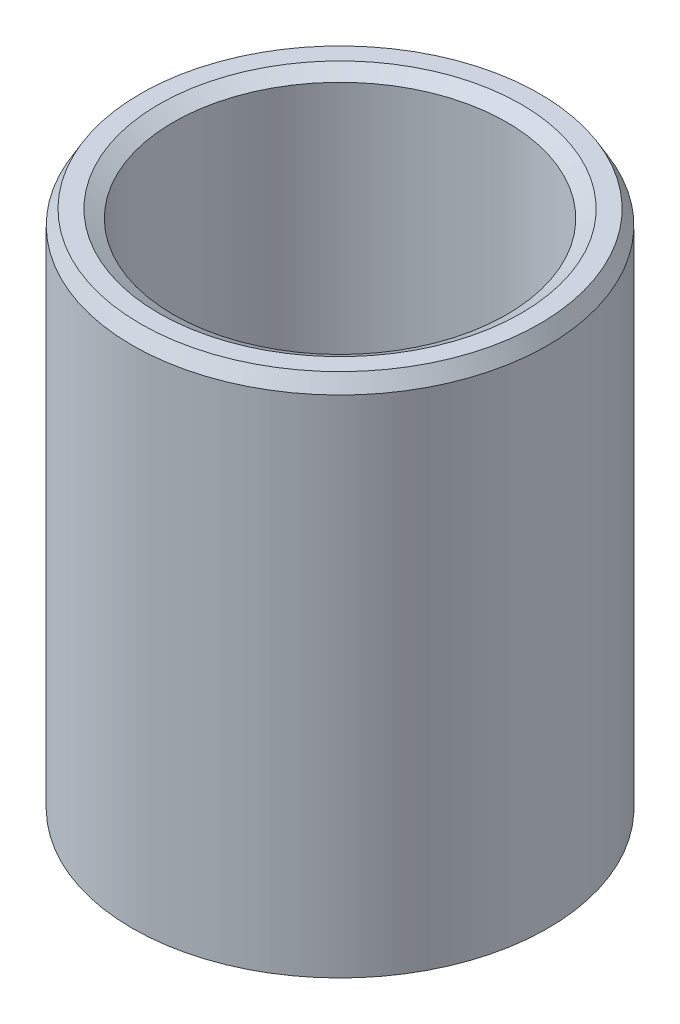
ISO-10303-21;
HEADER;
FILE_DESCRIPTION(('STEP AP214'),'2;1');
FILE_NAME('part.step','',(''),(''),'','','');
FILE_SCHEMA(('AUTOMOTIVE_DESIGN { 1 0 10303 214 1 1 1 1 }'));
ENDSEC;
DATA;
#1=APPLICATION_CONTEXT('core data for automotive mechanical design processes');
#2=APPLICATION_PROTOCOL_DEFINITION('international standard','automotive_design',2000,#1);
#3=PRODUCT_CONTEXT('',#1,'mechanical');
#4=PRODUCT('Part','Part','',(#3));
#5=PRODUCT_RELATED_PRODUCT_CATEGORY('part','',(#4));
#6=PRODUCT_DEFINITION_FORMATION('','',#4);
#7=PRODUCT_DEFINITION_CONTEXT('part definition',#1,'design');
#8=PRODUCT_DEFINITION('design','',#6,#7);
#9=PRODUCT_DEFINITION_SHAPE('','',#8);
#10=(LENGTH_UNIT() NAMED_UNIT(*) SI_UNIT(.MILLI.,.METRE.));
#11=(NAMED_UNIT(*) PLANE_ANGLE_UNIT() SI_UNIT($,.RADIAN.));
#12=(NAMED_UNIT(*) SI_UNIT($,.STERADIAN.) SOLID_ANGLE_UNIT());
#13=UNCERTAINTY_MEASURE_WITH_UNIT(LENGTH_MEASURE(1.E-05),#10,'distance_accuracy_value','');
#14=(GEOMETRIC_REPRESENTATION_CONTEXT(3) GLOBAL_UNCERTAINTY_ASSIGNED_CONTEXT((#13)) GLOBAL_UNIT_ASSIGNED_CONTEXT((#10,
#11,#12)) REPRESENTATION_CONTEXT('',''));
#15=CARTESIAN_POINT('',(0.,0.,0.));
#16=DIRECTION('',(0.,0.,1.));
#17=DIRECTION('',(1.,0.,0.));
#18=AXIS2_PLACEMENT_3D('',#15,#16,#17);
#19=CARTESIAN_POINT('',(0.,82.520346828198,0.));
#20=DIRECTION('',(0.,-1.,0.));
#21=DIRECTION('',(0.,0.,-1.));
#22=AXIS2_PLACEMENT_3D('',#19,#20,#21);
#23=CYLINDRICAL_SURFACE('',#22,32.5);
#24=CARTESIAN_POINT('',(0.,1.30030227955019,0.));
#25=DIRECTION('',(0.,1.,0.));
#26=DIRECTION('',(0.,0.,1.));
#27=AXIS2_PLACEMENT_3D('',#24,#25,#26);
#28=CIRCLE('',#27,32.5);
#29=CARTESIAN_POINT('',(0.,1.30030227955019,32.5));
#30=VERTEX_POINT('',#29);
#31=EDGE_CURVE('E10',#30,#30,#28,.T.);
#32=ORIENTED_EDGE('',*,*,#31,.T.);
#33=EDGE_LOOP('',(#32));
#34=FACE_BOUND('',#33,.T.);
#35=CARTESIAN_POINT('',(0.,80.2681572148194,0.));
#36=DIRECTION('',(0.,1.,0.));
#37=DIRECTION('',(0.,0.,1.));
#38=AXIS2_PLACEMENT_3D('',#35,#36,#37);
#39=CIRCLE('',#38,32.5);
#40=CARTESIAN_POINT('',(0.,80.2681572148194,32.5));
#41=VERTEX_POINT('',#40);
#42=EDGE_CURVE('E50',#41,#41,#39,.F.);
#43=ORIENTED_EDGE('',*,*,#42,.T.);
#44=EDGE_LOOP('',(#43));
#45=FACE_BOUND('',#44,.T.);
#46=ADVANCED_FACE('F39',(#34,#45),#23,.T.);
#47=CARTESIAN_POINT('',(0.,82.520346828198,0.));
#48=DIRECTION('',(0.,1.,0.));
#49=DIRECTION('',(0.,0.,1.));
#50=AXIS2_PLACEMENT_3D('',#47,#48,#49);
#51=PLANE('',#50);
#52=CARTESIAN_POINT('',(0.,82.520346828198,0.));
#53=DIRECTION('',(0.,1.,0.));
#54=DIRECTION('',(0.,0.,1.));
#55=AXIS2_PLACEMENT_3D('',#52,#53,#54);
#56=CIRCLE('',#55,28.3278194605698);
#57=CARTESIAN_POINT('',(0.,82.520346828198,28.3278194605698));
#58=VERTEX_POINT('',#57);
#59=EDGE_CURVE('E58',#58,#58,#56,.F.);
#60=ORIENTED_EDGE('',*,*,#59,.T.);
#61=EDGE_LOOP('',(#60));
#62=FACE_BOUND('',#61,.T.);
#63=CARTESIAN_POINT('',(0.,82.520346828198,0.));
#64=DIRECTION('',(0.,1.,0.));
#65=DIRECTION('',(0.,0.,1.));
#66=AXIS2_PLACEMENT_3D('',#63,#64,#65);
#67=CIRCLE('',#66,31.1996977204498);
#68=CARTESIAN_POINT('',(0.,82.520346828198,31.1996977204498));
#69=VERTEX_POINT('',#68);
#70=EDGE_CURVE('E61',#69,#69,#67,.T.);
#71=ORIENTED_EDGE('',*,*,#70,.T.);
#72=EDGE_LOOP('',(#71));
#73=FACE_BOUND('',#72,.T.);
#74=ADVANCED_FACE('F88',(#62,#73),#51,.T.);
#75=CARTESIAN_POINT('',(0.,0.,0.));
#76=DIRECTION('',(0.,1.,0.));
#77=DIRECTION('',(0.,0.,1.));
#78=AXIS2_PLACEMENT_3D('',#75,#76,#77);
#79=PLANE('',#78);
#80=CARTESIAN_POINT('',(0.,0.,0.));
#81=DIRECTION('',(0.,1.,0.));
#82=DIRECTION('',(0.,0.,1.));
#83=AXIS2_PLACEMENT_3D('',#80,#81,#82);
#84=CIRCLE('',#83,27.3759321267415);
#85=CARTESIAN_POINT('',(0.,0.,27.3759321267415));
#86=VERTEX_POINT('',#85);
#87=EDGE_CURVE('E51',#86,#86,#84,.T.);
#88=ORIENTED_EDGE('',*,*,#87,.T.);
#89=EDGE_LOOP('',(#88));
#90=FACE_BOUND('',#89,.T.);
#91=CARTESIAN_POINT('',(0.,0.,0.));
#92=DIRECTION('',(0.,1.,0.));
#93=DIRECTION('',(0.,0.,1.));
#94=AXIS2_PLACEMENT_3D('',#91,#92,#93);
#95=CIRCLE('',#94,30.2478103866214);
#96=CARTESIAN_POINT('',(0.,0.,30.2478103866214));
#97=VERTEX_POINT('',#96);
#98=EDGE_CURVE('E54',#97,#97,#95,.F.);
#99=ORIENTED_EDGE('',*,*,#98,.T.);
#100=EDGE_LOOP('',(#99));
#101=FACE_BOUND('',#100,.T.);
#102=ADVANCED_FACE('F83',(#90,#101),#79,.F.);
#103=CARTESIAN_POINT('',(0.,82.520346828198,0.));
#104=DIRECTION('',(0.,-1.,0.));
#105=DIRECTION('',(0.,0.,-1.));
#106=AXIS2_PLACEMENT_3D('',#103,#104,#105);
#107=CYLINDRICAL_SURFACE('',#106,26.0756298471913);
#108=CARTESIAN_POINT('',(0.,81.2200445486478,0.));
#109=DIRECTION('',(0.,1.,0.));
#110=DIRECTION('',(0.,0.,1.));
#111=AXIS2_PLACEMENT_3D('',#108,#109,#110);
#112=CIRCLE('',#111,26.0756298471913);
#113=CARTESIAN_POINT('',(0.,81.2200445486478,26.0756298471913));
#114=VERTEX_POINT('',#113);
#115=EDGE_CURVE('E67',#114,#114,#112,.T.);
#116=ORIENTED_EDGE('',*,*,#115,.T.);
#117=EDGE_LOOP('',(#116));
#118=FACE_BOUND('',#117,.T.);
#119=CARTESIAN_POINT('',(0.,2.25218961337859,0.));
#120=DIRECTION('',(0.,1.,0.));
#121=DIRECTION('',(0.,0.,1.));
#122=AXIS2_PLACEMENT_3D('',#119,#120,#121);
#123=CIRCLE('',#122,26.0756298471913);
#124=CARTESIAN_POINT('',(0.,2.25218961337859,26.0756298471913));
#125=VERTEX_POINT('',#124);
#126=EDGE_CURVE('E69',#125,#125,#123,.F.);
#127=ORIENTED_EDGE('',*,*,#126,.T.);
#128=EDGE_LOOP('',(#127));
#129=FACE_BOUND('',#128,.T.);
#130=ADVANCED_FACE('F71',(#118,#129),#107,.F.);
#131=CARTESIAN_POINT('',(0.,81.2200445486478,0.));
#132=DIRECTION('',(0.,1.,0.));
#133=DIRECTION('',(0.,0.,1.));
#134=AXIS2_PLACEMENT_3D('',#131,#132,#133);
#135=CONICAL_SURFACE('',#134,26.0756298471913,1.0471975511966);
#136=ORIENTED_EDGE('',*,*,#59,.F.);
#137=EDGE_LOOP('',(#136));
#138=FACE_BOUND('',#137,.T.);
#139=ORIENTED_EDGE('',*,*,#115,.F.);
#140=EDGE_LOOP('',(#139));
#141=FACE_BOUND('',#140,.T.);
#142=ADVANCED_FACE('F77',(#138,#141),#135,.F.);
#143=CARTESIAN_POINT('',(0.,0.,0.));
#144=DIRECTION('',(0.,-1.,0.));
#145=DIRECTION('',(0.,0.,-1.));
#146=AXIS2_PLACEMENT_3D('',#143,#144,#145);
#147=CONICAL_SURFACE('',#146,27.3759321267415,0.523598775598294);
#148=ORIENTED_EDGE('',*,*,#126,.F.);
#149=EDGE_LOOP('',(#148));
#150=FACE_BOUND('',#149,.T.);
#151=ORIENTED_EDGE('',*,*,#87,.F.);
#152=EDGE_LOOP('',(#151));
#153=FACE_BOUND('',#152,.T.);
#154=ADVANCED_FACE('F73',(#150,#153),#147,.F.);
#155=CARTESIAN_POINT('',(0.,1.30030227955019,0.));
#156=DIRECTION('',(0.,1.,0.));
#157=DIRECTION('',(0.,0.,1.));
#158=AXIS2_PLACEMENT_3D('',#155,#156,#157);
#159=CONICAL_SURFACE('',#158,32.5,1.0471975511966);
#160=CARTESIAN_POINT('',(0.,0.,30.2478103866214));
#161=CARTESIAN_POINT('',(0.,0.013544815411981,30.2712706950941));
#162=CARTESIAN_POINT('',(0.,0.0270896308239621,30.2947310035668));
#163=CARTESIAN_POINT('',(0.,0.0541792616479244,30.3416516205122));
#164=CARTESIAN_POINT('',(0.,0.0677240770599056,30.3651119289849));
#165=CARTESIAN_POINT('',(0.,0.0948137078838679,30.4120325459303));
#166=CARTESIAN_POINT('',(0.,0.108358523295849,30.435492854403));
#167=CARTESIAN_POINT('',(0.,0.135448154119811,30.4824134713484));
#168=CARTESIAN_POINT('',(0.,0.148992969531793,30.505873779821));
#169=CARTESIAN_POINT('',(0.,0.176082600355755,30.5527943967664));
#170=CARTESIAN_POINT('',(0.,0.189627415767736,30.5762547052391));
#171=CARTESIAN_POINT('',(0.,0.216717046591698,30.6231753221845));
#172=CARTESIAN_POINT('',(0.,0.23026186200368,30.6466356306572));
#173=CARTESIAN_POINT('',(0.,0.257351492827642,30.6935562476026));
#174=CARTESIAN_POINT('',(0.,0.270896308239623,30.7170165560753));
#175=CARTESIAN_POINT('',(0.,0.297985939063585,30.7639371730207));
#176=CARTESIAN_POINT('',(0.,0.311530754475567,30.7873974814934));
#177=CARTESIAN_POINT('',(0.,0.338620385299529,30.8343180984388));
#178=CARTESIAN_POINT('',(0.,0.35216520071151,30.8577784069114));
#179=CARTESIAN_POINT('',(0.,0.379254831535472,30.9046990238568));
#180=CARTESIAN_POINT('',(0.,0.392799646947454,30.9281593323295));
#181=CARTESIAN_POINT('',(0.,0.419889277771416,30.9750799492749));
#182=CARTESIAN_POINT('',(0.,0.433434093183397,30.9985402577476));
#183=CARTESIAN_POINT('',(0.,0.46052372400736,31.045460874693));
#184=CARTESIAN_POINT('',(0.,0.474068539419341,31.0689211831657));
#185=CARTESIAN_POINT('',(0.,0.501158170243303,31.1158418001111));
#186=CARTESIAN_POINT('',(0.,0.514702985655284,31.1393021085838));
#187=CARTESIAN_POINT('',(0.,0.541792616479246,31.1862227255292));
#188=CARTESIAN_POINT('',(0.,0.555337431891227,31.2096830340019));
#189=CARTESIAN_POINT('',(0.,0.58242706271519,31.2566036509472));
#190=CARTESIAN_POINT('',(0.,0.595971878127172,31.2800639594199));
#191=CARTESIAN_POINT('',(0.,0.623061508951134,31.3269845763653));
#192=CARTESIAN_POINT('',(0.,0.636606324363114,31.350444884838));
#193=CARTESIAN_POINT('',(0.,0.663695955187076,31.3973655017834));
#194=CARTESIAN_POINT('',(0.,0.677240770599059,31.4208258102561));
#195=CARTESIAN_POINT('',(0.,0.704330401423021,31.4677464272015));
#196=CARTESIAN_POINT('',(0.,0.717875216835001,31.4912067356742));
#197=CARTESIAN_POINT('',(0.,0.744964847658963,31.5381273526196));
#198=CARTESIAN_POINT('',(0.,0.758509663070946,31.5615876610923));
#199=CARTESIAN_POINT('',(0.,0.785599293894908,31.6085082780376));
#200=CARTESIAN_POINT('',(0.,0.799144109306888,31.6319685865103));
#201=CARTESIAN_POINT('',(0.,0.82623374013085,31.6788892034557));
#202=CARTESIAN_POINT('',(0.,0.839778555542833,31.7023495119284));
#203=CARTESIAN_POINT('',(0.,0.866868186366795,31.7492701288738));
#204=CARTESIAN_POINT('',(0.,0.880413001778775,31.7727304373465));
#205=CARTESIAN_POINT('',(0.,0.907502632602737,31.8196510542919));
#206=CARTESIAN_POINT('',(0.,0.921047448014719,31.8431113627646));
#207=CARTESIAN_POINT('',(0.,0.948137078838682,31.89003197971));
#208=CARTESIAN_POINT('',(0.,0.961681894250663,31.9134922881827));
#209=CARTESIAN_POINT('',(0.,0.988771525074625,31.960412905128));
#210=CARTESIAN_POINT('',(0.,1.00231634048661,31.9838732136007));
#211=CARTESIAN_POINT('',(0.,1.02940597131057,32.0307938305461));
#212=CARTESIAN_POINT('',(0.,1.04295078672255,32.0542541390188));
#213=CARTESIAN_POINT('',(0.,1.07004041754651,32.1011747559642));
#214=CARTESIAN_POINT('',(0.,1.08358523295849,32.1246350644369));
#215=CARTESIAN_POINT('',(0.,1.11067486378245,32.1715556813823));
#216=CARTESIAN_POINT('',(0.,1.12421967919444,32.195015989855));
#217=CARTESIAN_POINT('',(0.,1.1513093100184,32.2419366068004));
#218=CARTESIAN_POINT('',(0.,1.16485412543038,32.2653969152731));
#219=CARTESIAN_POINT('',(0.,1.19194375625434,32.3123175322185));
#220=CARTESIAN_POINT('',(0.,1.20548857166632,32.3357778406911));
#221=CARTESIAN_POINT('',(0.,1.23257820249029,32.3826984576365));
#222=CARTESIAN_POINT('',(0.,1.24612301790227,32.4061587661092));
#223=CARTESIAN_POINT('',(0.,1.27321264872623,32.4530793830546));
#224=CARTESIAN_POINT('',(0.,1.28675746413821,32.4765396915273));
#225=CARTESIAN_POINT('',(0.,1.30030227955019,32.5));
#226=B_SPLINE_CURVE_WITH_KNOTS('',3,(#160,#161,#162,#163,#164,#165,#166,#167,#168,#169,#170,
#171,#172,#173,#174,#175,#176,#177,#178,#179,#180,#181,#182,#183,#184,#185,#186,#187,#188,#189,
#190,#191,#192,#193,#194,#195,#196,#197,#198,#199,#200,#201,#202,#203,#204,#205,#206,#207,#208,
#209,#210,#211,#212,#213,#214,#215,#216,#217,#218,#219,#220,#221,#222,#223,#224,#225),
.UNSPECIFIED.,.F.,.F.,(4,2,2,2,2,2,2,2,2,2,2,2,2,2,2,2,2,2,2,2,2,2,2,2,2,2,2,2,2,2,2,2,4),(0.,
0.0812688924718876,0.162537784943775,0.243806677415663,0.325075569887551,0.406344462359438,
0.487613354831326,0.568882247303213,0.650151139775101,0.731420032246989,0.812688924718876,
0.893957817190764,0.975226709662652,1.05649560213454,1.13776449460643,1.21903338707831,
1.3003022795502,1.38157117202209,1.46284006449398,1.54410895696586,1.62537784943775,
1.70664674190964,1.78791563438153,1.86918452685341,1.9504534193253,2.03172231179719,
2.11299120426908,2.19426009674097,2.27552898921285,2.35679788168474,2.43806677415663,
2.51933566662852,2.6006045591004),.UNSPECIFIED.);
#227=EDGE_CURVE('BSEAM76',#97,#30,#226,.T.);
#228=ORIENTED_EDGE('',*,*,#98,.F.);
#229=ORIENTED_EDGE('',*,*,#31,.F.);
#230=ORIENTED_EDGE('',*,*,#227,.T.);
#231=ORIENTED_EDGE('',*,*,#227,.F.);
#232=EDGE_LOOP('',(#228,#230,#229,#231));
#233=FACE_BOUND('',#232,.T.);
#234=ADVANCED_FACE('F76',(#233),#159,.T.);
#235=CARTESIAN_POINT('',(0.,82.520346828198,0.));
#236=DIRECTION('',(0.,-1.,0.));
#237=DIRECTION('',(0.,0.,-1.));
#238=AXIS2_PLACEMENT_3D('',#235,#236,#237);
#239=CONICAL_SURFACE('',#238,31.1996977204498,0.523598775598297);
#240=ORIENTED_EDGE('',*,*,#42,.F.);
#241=EDGE_LOOP('',(#240));
#242=FACE_BOUND('',#241,.T.);
#243=ORIENTED_EDGE('',*,*,#70,.F.);
#244=EDGE_LOOP('',(#243));
#245=FACE_BOUND('',#244,.T.);
#246=ADVANCED_FACE('F45',(#242,#245),#239,.T.);
#247=CLOSED_SHELL('',(#46,#74,#102,#130,#142,#154,#234,#246));
#248=MANIFOLD_SOLID_BREP('B2',#247);
#249=ADVANCED_BREP_SHAPE_REPRESENTATION('',(#18,#248),#14);
#250=SHAPE_DEFINITION_REPRESENTATION(#9,#249);
ENDSEC;
END-ISO-10303-21;
